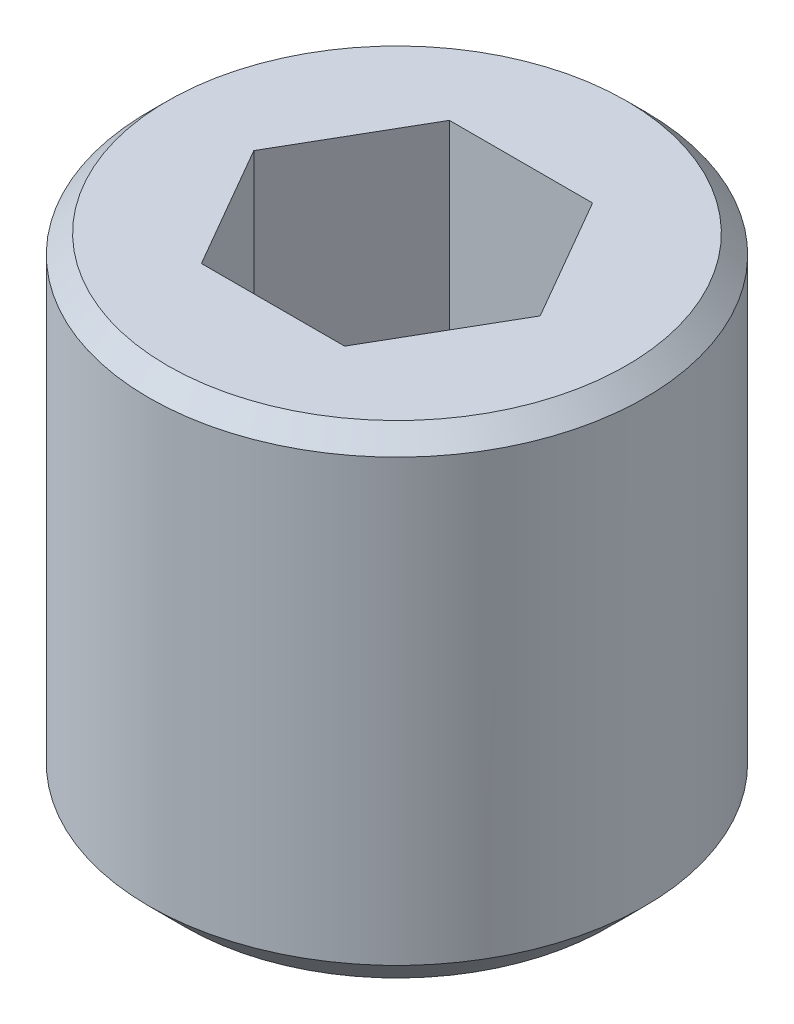
ISO-10303-21;
HEADER;
FILE_DESCRIPTION(('STEP AP214'),'2;1');
FILE_NAME('part.step','',(''),(''),'','','');
FILE_SCHEMA(('AUTOMOTIVE_DESIGN { 1 0 10303 214 1 1 1 1 }'));
ENDSEC;
DATA;
#1=APPLICATION_CONTEXT('core data for automotive mechanical design processes');
#2=APPLICATION_PROTOCOL_DEFINITION('international standard','automotive_design',2000,#1);
#3=PRODUCT_CONTEXT('',#1,'mechanical');
#4=PRODUCT('Part','Part','',(#3));
#5=PRODUCT_RELATED_PRODUCT_CATEGORY('part','',(#4));
#6=PRODUCT_DEFINITION_FORMATION('','',#4);
#7=PRODUCT_DEFINITION_CONTEXT('part definition',#1,'design');
#8=PRODUCT_DEFINITION('design','',#6,#7);
#9=PRODUCT_DEFINITION_SHAPE('','',#8);
#10=(LENGTH_UNIT() NAMED_UNIT(*) SI_UNIT(.MILLI.,.METRE.));
#11=(NAMED_UNIT(*) PLANE_ANGLE_UNIT() SI_UNIT($,.RADIAN.));
#12=(NAMED_UNIT(*) SI_UNIT($,.STERADIAN.) SOLID_ANGLE_UNIT());
#13=UNCERTAINTY_MEASURE_WITH_UNIT(LENGTH_MEASURE(1.E-05),#10,'distance_accuracy_value','');
#14=(GEOMETRIC_REPRESENTATION_CONTEXT(3) GLOBAL_UNCERTAINTY_ASSIGNED_CONTEXT((#13)) GLOBAL_UNIT_ASSIGNED_CONTEXT((#10,
#11,#12)) REPRESENTATION_CONTEXT('',''));
#15=CARTESIAN_POINT('',(0.,0.,0.));
#16=DIRECTION('',(0.,0.,1.));
#17=DIRECTION('',(1.,0.,0.));
#18=AXIS2_PLACEMENT_3D('',#15,#16,#17);
#19=CARTESIAN_POINT('',(0.,0.,0.));
#20=DIRECTION('',(0.,-1.,0.));
#21=DIRECTION('',(0.,0.,-1.));
#22=AXIS2_PLACEMENT_3D('',#19,#20,#21);
#23=PLANE('',#22);
#24=CARTESIAN_POINT('',(0.,0.,0.));
#25=DIRECTION('',(0.,-1.,0.));
#26=DIRECTION('',(0.,0.,-1.));
#27=AXIS2_PLACEMENT_3D('',#24,#25,#26);
#28=CIRCLE('',#27,1.85);
#29=CARTESIAN_POINT('',(0.,0.,-1.85));
#30=VERTEX_POINT('',#29);
#31=EDGE_CURVE('E44',#30,#30,#28,.F.);
#32=ORIENTED_EDGE('',*,*,#31,.T.);
#33=EDGE_LOOP('',(#32));
#34=FACE_BOUND('',#33,.T.);
#35=DIRECTION('',(-0.5,0.,0.866025403784439));
#36=VECTOR('',#35,1.);
#37=CARTESIAN_POINT('',(-0.577350269189626,0.,-1.));
#38=LINE('',#37,#36);
#39=CARTESIAN_POINT('',(-0.577350269189626,0.,-1.));
#40=VERTEX_POINT('',#39);
#41=CARTESIAN_POINT('',(-1.15470053837925,0.,0.));
#42=VERTEX_POINT('',#41);
#43=EDGE_CURVE('E125',#40,#42,#38,.T.);
#44=ORIENTED_EDGE('',*,*,#43,.F.);
#45=DIRECTION('',(-1.,0.,0.));
#46=VECTOR('',#45,1.);
#47=CARTESIAN_POINT('',(0.577350269189626,0.,-1.));
#48=LINE('',#47,#46);
#49=CARTESIAN_POINT('',(0.577350269189626,0.,-1.));
#50=VERTEX_POINT('',#49);
#51=EDGE_CURVE('E51',#50,#40,#48,.T.);
#52=ORIENTED_EDGE('',*,*,#51,.F.);
#53=DIRECTION('',(-0.5,0.,-0.866025403784438));
#54=VECTOR('',#53,1.);
#55=CARTESIAN_POINT('',(1.15470053837925,0.,0.));
#56=LINE('',#55,#54);
#57=CARTESIAN_POINT('',(1.15470053837925,0.,0.));
#58=VERTEX_POINT('',#57);
#59=EDGE_CURVE('E134',#58,#50,#56,.T.);
#60=ORIENTED_EDGE('',*,*,#59,.F.);
#61=DIRECTION('',(0.5,0.,-0.866025403784439));
#62=VECTOR('',#61,1.);
#63=CARTESIAN_POINT('',(0.577350269189626,0.,1.));
#64=LINE('',#63,#62);
#65=CARTESIAN_POINT('',(0.577350269189626,0.,1.));
#66=VERTEX_POINT('',#65);
#67=EDGE_CURVE('E132',#66,#58,#64,.T.);
#68=ORIENTED_EDGE('',*,*,#67,.F.);
#69=DIRECTION('',(1.,0.,0.));
#70=VECTOR('',#69,1.);
#71=CARTESIAN_POINT('',(-0.577350269189626,0.,1.));
#72=LINE('',#71,#70);
#73=CARTESIAN_POINT('',(-0.577350269189626,0.,1.));
#74=VERTEX_POINT('',#73);
#75=EDGE_CURVE('E99',#74,#66,#72,.T.);
#76=ORIENTED_EDGE('',*,*,#75,.F.);
#77=DIRECTION('',(0.5,0.,0.866025403784439));
#78=VECTOR('',#77,1.);
#79=CARTESIAN_POINT('',(-1.15470053837925,0.,0.));
#80=LINE('',#79,#78);
#81=EDGE_CURVE('E128',#42,#74,#80,.T.);
#82=ORIENTED_EDGE('',*,*,#81,.F.);
#83=EDGE_LOOP('',(#44,#52,#60,#68,#76,#82));
#84=FACE_BOUND('',#83,.T.);
#85=ADVANCED_FACE('F36',(#34,#84),#23,.F.);
#86=CARTESIAN_POINT('',(0.,0.,0.));
#87=DIRECTION('',(0.,1.,0.));
#88=DIRECTION('',(0.,0.,1.));
#89=AXIS2_PLACEMENT_3D('',#86,#87,#88);
#90=CYLINDRICAL_SURFACE('',#89,2.);
#91=CARTESIAN_POINT('',(0.,-0.150000000000002,0.));
#92=DIRECTION('',(0.,-1.,0.));
#93=DIRECTION('',(0.,0.,-1.));
#94=AXIS2_PLACEMENT_3D('',#91,#92,#93);
#95=CIRCLE('',#94,2.);
#96=CARTESIAN_POINT('',(0.,-0.150000000000002,-2.));
#97=VERTEX_POINT('',#96);
#98=EDGE_CURVE('E11',#97,#97,#95,.T.);
#99=ORIENTED_EDGE('',*,*,#98,.T.);
#100=EDGE_LOOP('',(#99));
#101=FACE_BOUND('',#100,.T.);
#102=CARTESIAN_POINT('',(0.,-3.7,0.));
#103=DIRECTION('',(0.,1.,0.));
#104=DIRECTION('',(0.,0.,1.));
#105=AXIS2_PLACEMENT_3D('',#102,#103,#104);
#106=CIRCLE('',#105,2.);
#107=CARTESIAN_POINT('',(0.,-3.7,2.));
#108=VERTEX_POINT('',#107);
#109=EDGE_CURVE('E138',#108,#108,#106,.T.);
#110=ORIENTED_EDGE('',*,*,#109,.T.);
#111=EDGE_LOOP('',(#110));
#112=FACE_BOUND('',#111,.T.);
#113=ADVANCED_FACE('F162',(#101,#112),#90,.T.);
#114=CARTESIAN_POINT('',(2.,-4.,0.));
#115=DIRECTION('',(0.,1.,0.));
#116=DIRECTION('',(0.,0.,1.));
#117=AXIS2_PLACEMENT_3D('',#114,#115,#116);
#118=PLANE('',#117);
#119=CARTESIAN_POINT('',(0.,-4.,0.));
#120=DIRECTION('',(0.,1.,0.));
#121=DIRECTION('',(0.,0.,1.));
#122=AXIS2_PLACEMENT_3D('',#119,#120,#121);
#123=CIRCLE('',#122,1.7);
#124=CARTESIAN_POINT('',(0.,-4.,1.7));
#125=VERTEX_POINT('',#124);
#126=EDGE_CURVE('E146',#125,#125,#123,.F.);
#127=ORIENTED_EDGE('',*,*,#126,.T.);
#128=EDGE_LOOP('',(#127));
#129=FACE_BOUND('',#128,.T.);
#130=ADVANCED_FACE('F167',(#129),#118,.F.);
#131=CARTESIAN_POINT('',(0.577350269189626,-2.,-1.));
#132=DIRECTION('',(0.,0.,-1.));
#133=DIRECTION('',(-1.,0.,0.));
#134=AXIS2_PLACEMENT_3D('',#131,#132,#133);
#135=PLANE('',#134);
#136=ORIENTED_EDGE('',*,*,#51,.T.);
#137=DIRECTION('',(0.,1.,0.));
#138=VECTOR('',#137,1.);
#139=CARTESIAN_POINT('',(-0.577350269189626,-2.,-1.));
#140=LINE('',#139,#138);
#141=CARTESIAN_POINT('',(-0.577350269189626,-2.,-1.));
#142=VERTEX_POINT('',#141);
#143=EDGE_CURVE('E81',#142,#40,#140,.T.);
#144=ORIENTED_EDGE('',*,*,#143,.F.);
#145=DIRECTION('',(-1.,0.,0.));
#146=VECTOR('',#145,1.);
#147=CARTESIAN_POINT('',(0.577350269189626,-2.,-1.));
#148=LINE('',#147,#146);
#149=CARTESIAN_POINT('',(0.577350269189626,-2.,-1.));
#150=VERTEX_POINT('',#149);
#151=EDGE_CURVE('E136',#150,#142,#148,.T.);
#152=ORIENTED_EDGE('',*,*,#151,.F.);
#153=DIRECTION('',(0.,1.,0.));
#154=VECTOR('',#153,1.);
#155=CARTESIAN_POINT('',(0.577350269189626,-2.,-1.));
#156=LINE('',#155,#154);
#157=EDGE_CURVE('E59',#150,#50,#156,.T.);
#158=ORIENTED_EDGE('',*,*,#157,.T.);
#159=EDGE_LOOP('',(#136,#144,#152,#158));
#160=FACE_BOUND('',#159,.T.);
#161=ADVANCED_FACE('F173',(#160),#135,.F.);
#162=CARTESIAN_POINT('',(1.15470053837925,-2.,0.));
#163=DIRECTION('',(0.866025403784439,0.,-0.5));
#164=DIRECTION('',(-0.5,0.,-0.866025403784439));
#165=AXIS2_PLACEMENT_3D('',#162,#163,#164);
#166=PLANE('',#165);
#167=ORIENTED_EDGE('',*,*,#59,.T.);
#168=ORIENTED_EDGE('',*,*,#157,.F.);
#169=DIRECTION('',(-0.5,0.,-0.866025403784438));
#170=VECTOR('',#169,1.);
#171=CARTESIAN_POINT('',(1.15470053837925,-2.,0.));
#172=LINE('',#171,#170);
#173=CARTESIAN_POINT('',(1.15470053837925,-2.,0.));
#174=VERTEX_POINT('',#173);
#175=EDGE_CURVE('E111',#174,#150,#172,.T.);
#176=ORIENTED_EDGE('',*,*,#175,.F.);
#177=DIRECTION('',(0.,1.,0.));
#178=VECTOR('',#177,1.);
#179=CARTESIAN_POINT('',(1.15470053837925,-2.,0.));
#180=LINE('',#179,#178);
#181=EDGE_CURVE('E103',#174,#58,#180,.T.);
#182=ORIENTED_EDGE('',*,*,#181,.T.);
#183=EDGE_LOOP('',(#167,#168,#176,#182));
#184=FACE_BOUND('',#183,.T.);
#185=ADVANCED_FACE('F177',(#184),#166,.F.);
#186=CARTESIAN_POINT('',(0.577350269189626,-2.,1.));
#187=DIRECTION('',(0.866025403784439,0.,0.5));
#188=DIRECTION('',(0.5,0.,-0.866025403784439));
#189=AXIS2_PLACEMENT_3D('',#186,#187,#188);
#190=PLANE('',#189);
#191=ORIENTED_EDGE('',*,*,#67,.T.);
#192=ORIENTED_EDGE('',*,*,#181,.F.);
#193=DIRECTION('',(0.5,0.,-0.866025403784439));
#194=VECTOR('',#193,1.);
#195=CARTESIAN_POINT('',(0.577350269189626,-2.,1.));
#196=LINE('',#195,#194);
#197=CARTESIAN_POINT('',(0.577350269189626,-2.,1.));
#198=VERTEX_POINT('',#197);
#199=EDGE_CURVE('E107',#198,#174,#196,.T.);
#200=ORIENTED_EDGE('',*,*,#199,.F.);
#201=DIRECTION('',(0.,1.,0.));
#202=VECTOR('',#201,1.);
#203=CARTESIAN_POINT('',(0.577350269189626,-2.,1.));
#204=LINE('',#203,#202);
#205=EDGE_CURVE('E92',#198,#66,#204,.T.);
#206=ORIENTED_EDGE('',*,*,#205,.T.);
#207=EDGE_LOOP('',(#191,#192,#200,#206));
#208=FACE_BOUND('',#207,.T.);
#209=ADVANCED_FACE('F108',(#208),#190,.F.);
#210=CARTESIAN_POINT('',(-0.577350269189626,-2.,1.));
#211=DIRECTION('',(0.,0.,1.));
#212=DIRECTION('',(1.,0.,0.));
#213=AXIS2_PLACEMENT_3D('',#210,#211,#212);
#214=PLANE('',#213);
#215=ORIENTED_EDGE('',*,*,#75,.T.);
#216=ORIENTED_EDGE('',*,*,#205,.F.);
#217=DIRECTION('',(1.,0.,0.));
#218=VECTOR('',#217,1.);
#219=CARTESIAN_POINT('',(-0.577350269189626,-2.,1.));
#220=LINE('',#219,#218);
#221=CARTESIAN_POINT('',(-0.577350269189626,-2.,1.));
#222=VERTEX_POINT('',#221);
#223=EDGE_CURVE('E96',#222,#198,#220,.T.);
#224=ORIENTED_EDGE('',*,*,#223,.F.);
#225=DIRECTION('',(0.,1.,0.));
#226=VECTOR('',#225,1.);
#227=CARTESIAN_POINT('',(-0.577350269189626,-2.,1.));
#228=LINE('',#227,#226);
#229=EDGE_CURVE('E104',#222,#74,#228,.T.);
#230=ORIENTED_EDGE('',*,*,#229,.T.);
#231=EDGE_LOOP('',(#215,#216,#224,#230));
#232=FACE_BOUND('',#231,.T.);
#233=ADVANCED_FACE('F94',(#232),#214,.F.);
#234=CARTESIAN_POINT('',(-1.15470053837925,-2.,0.));
#235=DIRECTION('',(-0.866025403784439,0.,0.5));
#236=DIRECTION('',(0.5,0.,0.866025403784439));
#237=AXIS2_PLACEMENT_3D('',#234,#235,#236);
#238=PLANE('',#237);
#239=ORIENTED_EDGE('',*,*,#81,.T.);
#240=ORIENTED_EDGE('',*,*,#229,.F.);
#241=DIRECTION('',(0.5,0.,0.866025403784439));
#242=VECTOR('',#241,1.);
#243=CARTESIAN_POINT('',(-1.15470053837925,-2.,0.));
#244=LINE('',#243,#242);
#245=CARTESIAN_POINT('',(-1.15470053837925,-2.,0.));
#246=VERTEX_POINT('',#245);
#247=EDGE_CURVE('E117',#246,#222,#244,.T.);
#248=ORIENTED_EDGE('',*,*,#247,.F.);
#249=DIRECTION('',(0.,1.,0.));
#250=VECTOR('',#249,1.);
#251=CARTESIAN_POINT('',(-1.15470053837925,-2.,0.));
#252=LINE('',#251,#250);
#253=EDGE_CURVE('E141',#246,#42,#252,.T.);
#254=ORIENTED_EDGE('',*,*,#253,.T.);
#255=EDGE_LOOP('',(#239,#240,#248,#254));
#256=FACE_BOUND('',#255,.T.);
#257=ADVANCED_FACE('F181',(#256),#238,.F.);
#258=CARTESIAN_POINT('',(-0.577350269189626,-2.,-1.));
#259=DIRECTION('',(-0.866025403784439,0.,-0.5));
#260=DIRECTION('',(-0.5,0.,0.866025403784439));
#261=AXIS2_PLACEMENT_3D('',#258,#259,#260);
#262=PLANE('',#261);
#263=ORIENTED_EDGE('',*,*,#43,.T.);
#264=ORIENTED_EDGE('',*,*,#253,.F.);
#265=DIRECTION('',(-0.5,0.,0.866025403784439));
#266=VECTOR('',#265,1.);
#267=CARTESIAN_POINT('',(-0.577350269189626,-2.,-1.));
#268=LINE('',#267,#266);
#269=EDGE_CURVE('E119',#142,#246,#268,.T.);
#270=ORIENTED_EDGE('',*,*,#269,.F.);
#271=ORIENTED_EDGE('',*,*,#143,.T.);
#272=EDGE_LOOP('',(#263,#264,#270,#271));
#273=FACE_BOUND('',#272,.T.);
#274=ADVANCED_FACE('F178',(#273),#262,.F.);
#275=CARTESIAN_POINT('',(-0.577350269189626,-2.,-1.));
#276=DIRECTION('',(0.,1.,0.));
#277=DIRECTION('',(0.,0.,1.));
#278=AXIS2_PLACEMENT_3D('',#275,#276,#277);
#279=PLANE('',#278);
#280=ORIENTED_EDGE('',*,*,#151,.T.);
#281=ORIENTED_EDGE('',*,*,#269,.T.);
#282=ORIENTED_EDGE('',*,*,#247,.T.);
#283=ORIENTED_EDGE('',*,*,#223,.T.);
#284=ORIENTED_EDGE('',*,*,#199,.T.);
#285=ORIENTED_EDGE('',*,*,#175,.T.);
#286=EDGE_LOOP('',(#280,#281,#282,#283,#284,#285));
#287=FACE_BOUND('',#286,.T.);
#288=ADVANCED_FACE('F114',(#287),#279,.T.);
#289=CARTESIAN_POINT('',(0.,-3.7,0.));
#290=DIRECTION('',(0.,1.,0.));
#291=DIRECTION('',(0.,0.,1.));
#292=AXIS2_PLACEMENT_3D('',#289,#290,#291);
#293=CONICAL_SURFACE('',#292,2.,0.78539816339745);
#294=ORIENTED_EDGE('',*,*,#126,.F.);
#295=EDGE_LOOP('',(#294));
#296=FACE_BOUND('',#295,.T.);
#297=ORIENTED_EDGE('',*,*,#109,.F.);
#298=EDGE_LOOP('',(#297));
#299=FACE_BOUND('',#298,.T.);
#300=ADVANCED_FACE('F154',(#296,#299),#293,.T.);
#301=CARTESIAN_POINT('',(0.,0.,0.));
#302=DIRECTION('',(0.,-1.,0.));
#303=DIRECTION('',(0.,0.,-1.));
#304=AXIS2_PLACEMENT_3D('',#301,#302,#303);
#305=CONICAL_SURFACE('',#304,1.85,0.785398163397445);
#306=ORIENTED_EDGE('',*,*,#98,.F.);
#307=EDGE_LOOP('',(#306));
#308=FACE_BOUND('',#307,.T.);
#309=ORIENTED_EDGE('',*,*,#31,.F.);
#310=EDGE_LOOP('',(#309));
#311=FACE_BOUND('',#310,.T.);
#312=ADVANCED_FACE('F38',(#308,#311),#305,.T.);
#313=CLOSED_SHELL('',(#85,#113,#130,#161,#185,#209,#233,#257,#274,#288,#300,#312));
#314=MANIFOLD_SOLID_BREP('B2',#313);
#315=ADVANCED_BREP_SHAPE_REPRESENTATION('',(#18,#314),#14);
#316=SHAPE_DEFINITION_REPRESENTATION(#9,#315);
ENDSEC;
END-ISO-10303-21;
